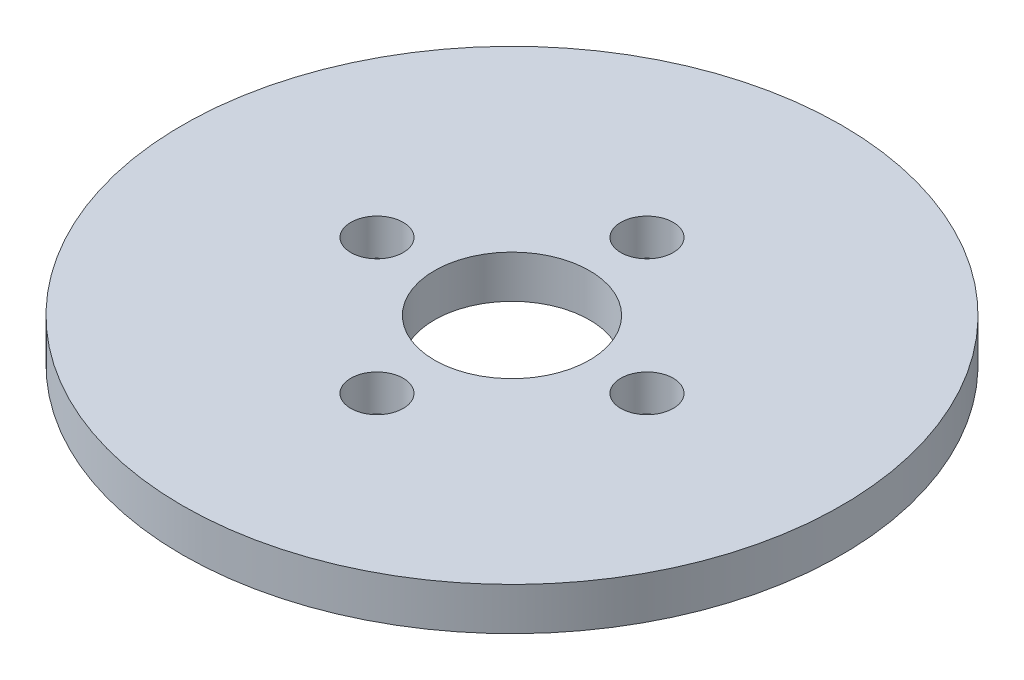
ISO-10303-21;
HEADER;
FILE_DESCRIPTION(('STEP AP214'),'2;1');
FILE_NAME('part.step','',(''),(''),'','','');
FILE_SCHEMA(('AUTOMOTIVE_DESIGN { 1 0 10303 214 1 1 1 1 }'));
ENDSEC;
DATA;
#1=APPLICATION_CONTEXT('core data for automotive mechanical design processes');
#2=APPLICATION_PROTOCOL_DEFINITION('international standard','automotive_design',2000,#1);
#3=PRODUCT_CONTEXT('',#1,'mechanical');
#4=PRODUCT('Part','Part','',(#3));
#5=PRODUCT_RELATED_PRODUCT_CATEGORY('part','',(#4));
#6=PRODUCT_DEFINITION_FORMATION('','',#4);
#7=PRODUCT_DEFINITION_CONTEXT('part definition',#1,'design');
#8=PRODUCT_DEFINITION('design','',#6,#7);
#9=PRODUCT_DEFINITION_SHAPE('','',#8);
#10=(LENGTH_UNIT() NAMED_UNIT(*) SI_UNIT(.MILLI.,.METRE.));
#11=(NAMED_UNIT(*) PLANE_ANGLE_UNIT() SI_UNIT($,.RADIAN.));
#12=(NAMED_UNIT(*) SI_UNIT($,.STERADIAN.) SOLID_ANGLE_UNIT());
#13=UNCERTAINTY_MEASURE_WITH_UNIT(LENGTH_MEASURE(1.E-05),#10,'distance_accuracy_value','');
#14=(GEOMETRIC_REPRESENTATION_CONTEXT(3) GLOBAL_UNCERTAINTY_ASSIGNED_CONTEXT((#13)) GLOBAL_UNIT_ASSIGNED_CONTEXT((#10,
#11,#12)) REPRESENTATION_CONTEXT('',''));
#15=CARTESIAN_POINT('',(0.,0.,0.));
#16=DIRECTION('',(0.,0.,1.));
#17=DIRECTION('',(1.,0.,0.));
#18=AXIS2_PLACEMENT_3D('',#15,#16,#17);
#19=CARTESIAN_POINT('',(0.,11.,0.));
#20=DIRECTION('',(0.,-1.,0.));
#21=DIRECTION('',(0.,0.,-1.));
#22=AXIS2_PLACEMENT_3D('',#19,#20,#21);
#23=CYLINDRICAL_SURFACE('',#22,85.);
#24=CARTESIAN_POINT('',(0.,11.,0.));
#25=DIRECTION('',(0.,1.,0.));
#26=DIRECTION('',(0.,0.,1.));
#27=AXIS2_PLACEMENT_3D('',#24,#25,#26);
#28=CIRCLE('',#27,85.);
#29=CARTESIAN_POINT('',(0.,11.,85.));
#30=VERTEX_POINT('',#29);
#31=EDGE_CURVE('E10',#30,#30,#28,.T.);
#32=ORIENTED_EDGE('',*,*,#31,.F.);
#33=EDGE_LOOP('',(#32));
#34=FACE_BOUND('',#33,.T.);
#35=CARTESIAN_POINT('',(0.,0.,0.));
#36=DIRECTION('',(0.,1.,0.));
#37=DIRECTION('',(0.,0.,1.));
#38=AXIS2_PLACEMENT_3D('',#35,#36,#37);
#39=CIRCLE('',#38,85.);
#40=CARTESIAN_POINT('',(0.,0.,85.));
#41=VERTEX_POINT('',#40);
#42=EDGE_CURVE('E37',#41,#41,#39,.T.);
#43=ORIENTED_EDGE('',*,*,#42,.T.);
#44=EDGE_LOOP('',(#43));
#45=FACE_BOUND('',#44,.T.);
#46=ADVANCED_FACE('F40',(#34,#45),#23,.T.);
#47=CARTESIAN_POINT('',(0.,11.,0.));
#48=DIRECTION('',(0.,1.,0.));
#49=DIRECTION('',(0.,0.,1.));
#50=AXIS2_PLACEMENT_3D('',#47,#48,#49);
#51=PLANE('',#50);
#52=CARTESIAN_POINT('',(1.215694991116E-13,11.,34.8188884067988));
#53=DIRECTION('',(0.,1.,0.));
#54=DIRECTION('',(1.,0.,0.));
#55=AXIS2_PLACEMENT_3D('',#52,#53,#54);
#56=CIRCLE('',#55,6.75801209324525);
#57=CARTESIAN_POINT('',(6.75801209324537,11.,34.8188884067988));
#58=VERTEX_POINT('',#57);
#59=EDGE_CURVE('E71',#58,#58,#56,.T.);
#60=ORIENTED_EDGE('',*,*,#59,.F.);
#61=EDGE_LOOP('',(#60));
#62=FACE_BOUND('',#61,.T.);
#63=CARTESIAN_POINT('',(34.8188884067988,11.,0.));
#64=DIRECTION('',(0.,1.,0.));
#65=DIRECTION('',(0.,0.,-1.));
#66=AXIS2_PLACEMENT_3D('',#63,#64,#65);
#67=CIRCLE('',#66,6.75801209324525);
#68=CARTESIAN_POINT('',(34.8188884067988,11.,-6.75801209324525));
#69=VERTEX_POINT('',#68);
#70=EDGE_CURVE('E70',#69,#69,#67,.T.);
#71=ORIENTED_EDGE('',*,*,#70,.F.);
#72=EDGE_LOOP('',(#71));
#73=FACE_BOUND('',#72,.T.);
#74=CARTESIAN_POINT('',(-3.64708497334799E-13,11.,-34.8188884067988));
#75=DIRECTION('',(0.,1.,0.));
#76=DIRECTION('',(-1.,0.,0.));
#77=AXIS2_PLACEMENT_3D('',#74,#75,#76);
#78=CIRCLE('',#77,6.75801209324525);
#79=CARTESIAN_POINT('',(-6.75801209324561,11.,-34.8188884067988));
#80=VERTEX_POINT('',#79);
#81=EDGE_CURVE('E61',#80,#80,#78,.T.);
#82=ORIENTED_EDGE('',*,*,#81,.F.);
#83=EDGE_LOOP('',(#82));
#84=FACE_BOUND('',#83,.T.);
#85=CARTESIAN_POINT('',(-34.8188884067988,11.,0.));
#86=DIRECTION('',(0.,1.,0.));
#87=DIRECTION('',(0.,0.,1.));
#88=AXIS2_PLACEMENT_3D('',#85,#86,#87);
#89=CIRCLE('',#88,6.75801209324525);
#90=CARTESIAN_POINT('',(-34.8188884067988,11.,6.75801209324525));
#91=VERTEX_POINT('',#90);
#92=EDGE_CURVE('E54',#91,#91,#89,.T.);
#93=ORIENTED_EDGE('',*,*,#92,.F.);
#94=EDGE_LOOP('',(#93));
#95=FACE_BOUND('',#94,.T.);
#96=CARTESIAN_POINT('',(0.,11.,0.));
#97=DIRECTION('',(0.,1.,0.));
#98=DIRECTION('',(0.,0.,1.));
#99=AXIS2_PLACEMENT_3D('',#96,#97,#98);
#100=CIRCLE('',#99,20.);
#101=CARTESIAN_POINT('',(0.,11.,20.));
#102=VERTEX_POINT('',#101);
#103=EDGE_CURVE('E50',#102,#102,#100,.T.);
#104=ORIENTED_EDGE('',*,*,#103,.F.);
#105=EDGE_LOOP('',(#104));
#106=FACE_BOUND('',#105,.T.);
#107=ORIENTED_EDGE('',*,*,#31,.T.);
#108=EDGE_LOOP('',(#107));
#109=FACE_BOUND('',#108,.T.);
#110=ADVANCED_FACE('F86',(#62,#73,#84,#95,#106,#109),#51,.T.);
#111=CARTESIAN_POINT('',(0.,0.,0.));
#112=DIRECTION('',(0.,1.,0.));
#113=DIRECTION('',(0.,0.,1.));
#114=AXIS2_PLACEMENT_3D('',#111,#112,#113);
#115=PLANE('',#114);
#116=CARTESIAN_POINT('',(0.,0.,0.));
#117=DIRECTION('',(0.,1.,0.));
#118=DIRECTION('',(0.,0.,1.));
#119=AXIS2_PLACEMENT_3D('',#116,#117,#118);
#120=CIRCLE('',#119,20.);
#121=CARTESIAN_POINT('',(0.,0.,20.));
#122=VERTEX_POINT('',#121);
#123=EDGE_CURVE('E47',#122,#122,#120,.T.);
#124=ORIENTED_EDGE('',*,*,#123,.T.);
#125=EDGE_LOOP('',(#124));
#126=FACE_BOUND('',#125,.T.);
#127=ORIENTED_EDGE('',*,*,#42,.F.);
#128=EDGE_LOOP('',(#127));
#129=FACE_BOUND('',#128,.T.);
#130=ADVANCED_FACE('F93',(#126,#129),#115,.F.);
#131=CARTESIAN_POINT('',(0.,11.,0.));
#132=DIRECTION('',(0.,-1.,0.));
#133=DIRECTION('',(0.,0.,-1.));
#134=AXIS2_PLACEMENT_3D('',#131,#132,#133);
#135=CYLINDRICAL_SURFACE('',#134,20.);
#136=ORIENTED_EDGE('',*,*,#103,.T.);
#137=EDGE_LOOP('',(#136));
#138=FACE_BOUND('',#137,.T.);
#139=ORIENTED_EDGE('',*,*,#123,.F.);
#140=EDGE_LOOP('',(#139));
#141=FACE_BOUND('',#140,.T.);
#142=ADVANCED_FACE('F101',(#138,#141),#135,.F.);
#143=CARTESIAN_POINT('',(-34.8188884067988,1.58553546862942,0.));
#144=DIRECTION('',(0.,1.,0.));
#145=DIRECTION('',(0.,0.,1.));
#146=AXIS2_PLACEMENT_3D('',#143,#144,#145);
#147=CYLINDRICAL_SURFACE('',#146,6.75801209324525);
#148=CARTESIAN_POINT('',(-34.8188884067988,1.58553546862942,0.));
#149=DIRECTION('',(0.,1.,0.));
#150=DIRECTION('',(0.,0.,1.));
#151=AXIS2_PLACEMENT_3D('',#148,#149,#150);
#152=CIRCLE('',#151,6.75801209324525);
#153=CARTESIAN_POINT('',(-34.8188884067988,1.58553546862942,6.75801209324525));
#154=VERTEX_POINT('',#153);
#155=EDGE_CURVE('E55',#154,#154,#152,.T.);
#156=ORIENTED_EDGE('',*,*,#155,.F.);
#157=EDGE_LOOP('',(#156));
#158=FACE_BOUND('',#157,.T.);
#159=ORIENTED_EDGE('',*,*,#92,.T.);
#160=EDGE_LOOP('',(#159));
#161=FACE_BOUND('',#160,.T.);
#162=ADVANCED_FACE('F102',(#158,#161),#147,.F.);
#163=CARTESIAN_POINT('',(-34.8188884067988,1.58553546862942,0.));
#164=DIRECTION('',(0.,1.,0.));
#165=DIRECTION('',(0.,0.,1.));
#166=AXIS2_PLACEMENT_3D('',#163,#164,#165);
#167=PLANE('',#166);
#168=ORIENTED_EDGE('',*,*,#155,.T.);
#169=EDGE_LOOP('',(#168));
#170=FACE_BOUND('',#169,.T.);
#171=ADVANCED_FACE('F133',(#170),#167,.T.);
#172=CARTESIAN_POINT('',(-3.64708497334799E-13,1.58553546862942,-34.8188884067988));
#173=DIRECTION('',(0.,1.,0.));
#174=DIRECTION('',(0.,0.,1.));
#175=AXIS2_PLACEMENT_3D('',#172,#173,#174);
#176=CYLINDRICAL_SURFACE('',#175,6.75801209324525);
#177=CARTESIAN_POINT('',(-3.64708497334799E-13,1.58553546862942,-34.8188884067988));
#178=DIRECTION('',(0.,1.,0.));
#179=DIRECTION('',(-1.,0.,0.));
#180=AXIS2_PLACEMENT_3D('',#177,#178,#179);
#181=CIRCLE('',#180,6.75801209324525);
#182=CARTESIAN_POINT('',(-6.75801209324561,1.58553546862942,-34.8188884067988));
#183=VERTEX_POINT('',#182);
#184=EDGE_CURVE('E63',#183,#183,#181,.T.);
#185=ORIENTED_EDGE('',*,*,#184,.F.);
#186=EDGE_LOOP('',(#185));
#187=FACE_BOUND('',#186,.T.);
#188=ORIENTED_EDGE('',*,*,#81,.T.);
#189=EDGE_LOOP('',(#188));
#190=FACE_BOUND('',#189,.T.);
#191=ADVANCED_FACE('F142',(#187,#190),#176,.F.);
#192=CARTESIAN_POINT('',(-3.64708497334799E-13,1.58553546862942,-34.8188884067988));
#193=DIRECTION('',(0.,1.,0.));
#194=DIRECTION('',(-1.,0.,0.));
#195=AXIS2_PLACEMENT_3D('',#192,#193,#194);
#196=PLANE('',#195);
#197=ORIENTED_EDGE('',*,*,#184,.T.);
#198=EDGE_LOOP('',(#197));
#199=FACE_BOUND('',#198,.T.);
#200=ADVANCED_FACE('F156',(#199),#196,.T.);
#201=CARTESIAN_POINT('',(34.8188884067988,1.58553546862942,0.));
#202=DIRECTION('',(0.,1.,0.));
#203=DIRECTION('',(0.,0.,1.));
#204=AXIS2_PLACEMENT_3D('',#201,#202,#203);
#205=CYLINDRICAL_SURFACE('',#204,6.75801209324525);
#206=CARTESIAN_POINT('',(34.8188884067988,1.58553546862942,0.));
#207=DIRECTION('',(0.,1.,0.));
#208=DIRECTION('',(0.,0.,-1.));
#209=AXIS2_PLACEMENT_3D('',#206,#207,#208);
#210=CIRCLE('',#209,6.75801209324525);
#211=CARTESIAN_POINT('',(34.8188884067988,1.58553546862942,-6.75801209324525));
#212=VERTEX_POINT('',#211);
#213=EDGE_CURVE('E69',#212,#212,#210,.T.);
#214=ORIENTED_EDGE('',*,*,#213,.F.);
#215=EDGE_LOOP('',(#214));
#216=FACE_BOUND('',#215,.T.);
#217=ORIENTED_EDGE('',*,*,#70,.T.);
#218=EDGE_LOOP('',(#217));
#219=FACE_BOUND('',#218,.T.);
#220=ADVANCED_FACE('F164',(#216,#219),#205,.F.);
#221=CARTESIAN_POINT('',(34.8188884067988,1.58553546862942,0.));
#222=DIRECTION('',(0.,1.,0.));
#223=DIRECTION('',(0.,0.,-1.));
#224=AXIS2_PLACEMENT_3D('',#221,#222,#223);
#225=PLANE('',#224);
#226=ORIENTED_EDGE('',*,*,#213,.T.);
#227=EDGE_LOOP('',(#226));
#228=FACE_BOUND('',#227,.T.);
#229=ADVANCED_FACE('F83',(#228),#225,.T.);
#230=CARTESIAN_POINT('',(1.215694991116E-13,1.58553546862942,34.8188884067988));
#231=DIRECTION('',(0.,1.,0.));
#232=DIRECTION('',(0.,0.,1.));
#233=AXIS2_PLACEMENT_3D('',#230,#231,#232);
#234=CYLINDRICAL_SURFACE('',#233,6.75801209324525);
#235=CARTESIAN_POINT('',(1.215694991116E-13,1.58553546862942,34.8188884067988));
#236=DIRECTION('',(0.,1.,0.));
#237=DIRECTION('',(1.,0.,0.));
#238=AXIS2_PLACEMENT_3D('',#235,#236,#237);
#239=CIRCLE('',#238,6.75801209324525);
#240=CARTESIAN_POINT('',(6.75801209324537,1.58553546862942,34.8188884067988));
#241=VERTEX_POINT('',#240);
#242=EDGE_CURVE('E59',#241,#241,#239,.T.);
#243=ORIENTED_EDGE('',*,*,#242,.F.);
#244=EDGE_LOOP('',(#243));
#245=FACE_BOUND('',#244,.T.);
#246=ORIENTED_EDGE('',*,*,#59,.T.);
#247=EDGE_LOOP('',(#246));
#248=FACE_BOUND('',#247,.T.);
#249=ADVANCED_FACE('F81',(#245,#248),#234,.F.);
#250=CARTESIAN_POINT('',(1.215694991116E-13,1.58553546862942,34.8188884067988));
#251=DIRECTION('',(0.,1.,0.));
#252=DIRECTION('',(1.,0.,0.));
#253=AXIS2_PLACEMENT_3D('',#250,#251,#252);
#254=PLANE('',#253);
#255=ORIENTED_EDGE('',*,*,#242,.T.);
#256=EDGE_LOOP('',(#255));
#257=FACE_BOUND('',#256,.T.);
#258=ADVANCED_FACE('F78',(#257),#254,.T.);
#259=CLOSED_SHELL('',(#46,#110,#130,#142,#162,#171,#191,#200,#220,#229,#249,#258));
#260=MANIFOLD_SOLID_BREP('B2',#259);
#261=ADVANCED_BREP_SHAPE_REPRESENTATION('',(#18,#260),#14);
#262=SHAPE_DEFINITION_REPRESENTATION(#9,#261);
ENDSEC;
END-ISO-10303-21;
